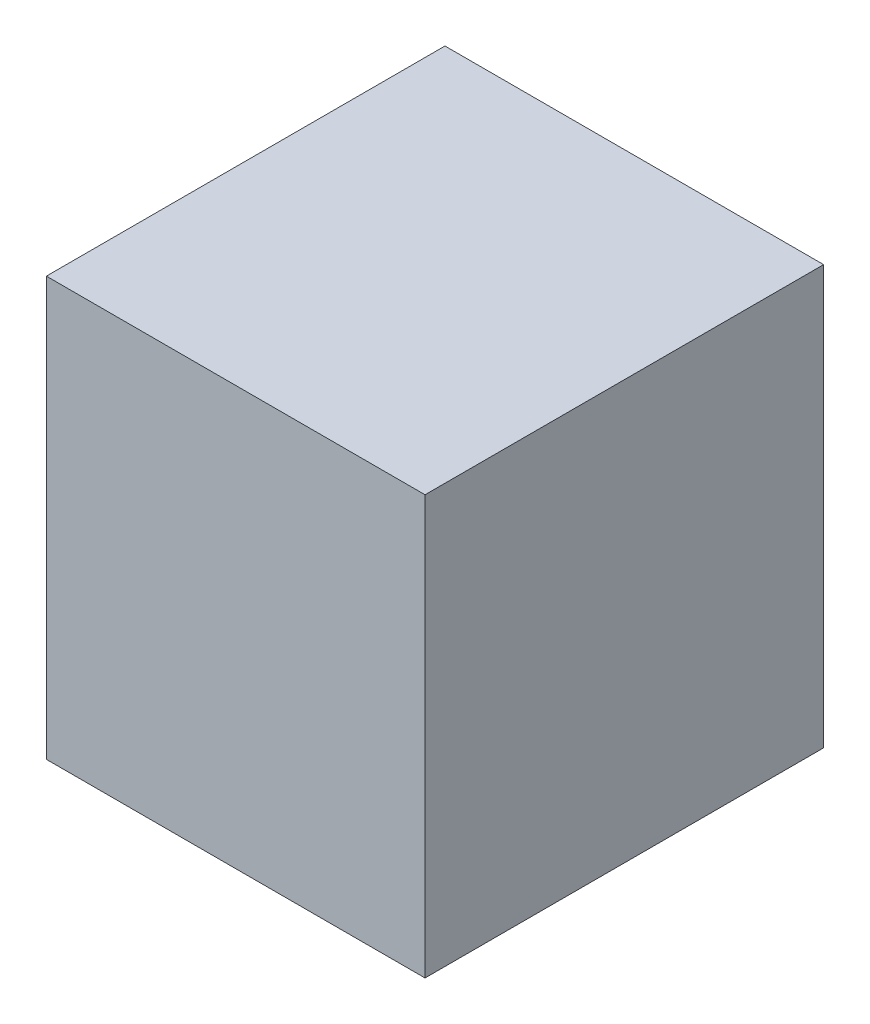
ISO-10303-21;
HEADER;
FILE_DESCRIPTION(('STEP AP214'),'2;1');
FILE_NAME('part.step','',(''),(''),'','','');
FILE_SCHEMA(('AUTOMOTIVE_DESIGN { 1 0 10303 214 1 1 1 1 }'));
ENDSEC;
DATA;
#1=APPLICATION_CONTEXT('core data for automotive mechanical design processes');
#2=APPLICATION_PROTOCOL_DEFINITION('international standard','automotive_design',2000,#1);
#3=PRODUCT_CONTEXT('',#1,'mechanical');
#4=PRODUCT('Part','Part','',(#3));
#5=PRODUCT_RELATED_PRODUCT_CATEGORY('part','',(#4));
#6=PRODUCT_DEFINITION_FORMATION('','',#4);
#7=PRODUCT_DEFINITION_CONTEXT('part definition',#1,'design');
#8=PRODUCT_DEFINITION('design','',#6,#7);
#9=PRODUCT_DEFINITION_SHAPE('','',#8);
#10=(LENGTH_UNIT() NAMED_UNIT(*) SI_UNIT(.MILLI.,.METRE.));
#11=(NAMED_UNIT(*) PLANE_ANGLE_UNIT() SI_UNIT($,.RADIAN.));
#12=(NAMED_UNIT(*) SI_UNIT($,.STERADIAN.) SOLID_ANGLE_UNIT());
#13=UNCERTAINTY_MEASURE_WITH_UNIT(LENGTH_MEASURE(1.E-05),#10,'distance_accuracy_value','');
#14=(GEOMETRIC_REPRESENTATION_CONTEXT(3) GLOBAL_UNCERTAINTY_ASSIGNED_CONTEXT((#13)) GLOBAL_UNIT_ASSIGNED_CONTEXT((#10,
#11,#12)) REPRESENTATION_CONTEXT('',''));
#15=CARTESIAN_POINT('',(0.,0.,0.));
#16=DIRECTION('',(0.,0.,1.));
#17=DIRECTION('',(1.,0.,0.));
#18=AXIS2_PLACEMENT_3D('',#15,#16,#17);
#19=CARTESIAN_POINT('',(0.47500032,0.52499768,0.));
#20=DIRECTION('',(-2.67368955473714E-06,-0.999999999996426,0.));
#21=DIRECTION('',(-0.999999999996426,2.67368955473714E-06,0.));
#22=AXIS2_PLACEMENT_3D('',#19,#20,#21);
#23=PLANE('',#22);
#24=DIRECTION('',(-0.999999999996426,2.67368955473714E-06,0.));
#25=VECTOR('',#24,1.);
#26=CARTESIAN_POINT('',(0.47500032,0.52499768,0.));
#27=LINE('',#26,#25);
#28=CARTESIAN_POINT('',(0.47500032,0.52499768,0.));
#29=VERTEX_POINT('',#28);
#30=CARTESIAN_POINT('',(-0.47499778,0.52500022,0.));
#31=VERTEX_POINT('',#30);
#32=EDGE_CURVE('E11',#29,#31,#27,.T.);
#33=ORIENTED_EDGE('',*,*,#32,.T.);
#34=DIRECTION('',(0.,0.,1.));
#35=VECTOR('',#34,1.);
#36=CARTESIAN_POINT('',(-0.47499778,0.52500022,0.));
#37=LINE('',#36,#35);
#38=CARTESIAN_POINT('',(-0.47499778,0.52500022,1.00000054));
#39=VERTEX_POINT('',#38);
#40=EDGE_CURVE('E24',#31,#39,#37,.T.);
#41=ORIENTED_EDGE('',*,*,#40,.T.);
#42=DIRECTION('',(-0.999999999996426,2.67368955473714E-06,0.));
#43=VECTOR('',#42,1.);
#44=CARTESIAN_POINT('',(0.47500032,0.52499768,1.00000054));
#45=LINE('',#44,#43);
#46=CARTESIAN_POINT('',(0.47500032,0.52499768,1.00000054));
#47=VERTEX_POINT('',#46);
#48=EDGE_CURVE('E87',#47,#39,#45,.T.);
#49=ORIENTED_EDGE('',*,*,#48,.F.);
#50=DIRECTION('',(0.,0.,1.));
#51=VECTOR('',#50,1.);
#52=CARTESIAN_POINT('',(0.47500032,0.52499768,0.));
#53=LINE('',#52,#51);
#54=EDGE_CURVE('E36',#29,#47,#53,.T.);
#55=ORIENTED_EDGE('',*,*,#54,.F.);
#56=EDGE_LOOP('',(#33,#41,#49,#55));
#57=FACE_BOUND('',#56,.T.);
#58=ADVANCED_FACE('F17',(#57),#23,.F.);
#59=CARTESIAN_POINT('',(-0.47499778,0.52500022,0.));
#60=DIRECTION('',(1.,0.,0.));
#61=DIRECTION('',(0.,-1.,0.));
#62=AXIS2_PLACEMENT_3D('',#59,#60,#61);
#63=PLANE('',#62);
#64=DIRECTION('',(0.,-1.,0.));
#65=VECTOR('',#64,1.);
#66=CARTESIAN_POINT('',(-0.47499778,0.52500022,0.));
#67=LINE('',#66,#65);
#68=CARTESIAN_POINT('',(-0.47499778,-0.52500022,0.));
#69=VERTEX_POINT('',#68);
#70=EDGE_CURVE('E84',#31,#69,#67,.T.);
#71=ORIENTED_EDGE('',*,*,#70,.T.);
#72=DIRECTION('',(0.,0.,1.));
#73=VECTOR('',#72,1.);
#74=CARTESIAN_POINT('',(-0.47499778,-0.52500022,0.));
#75=LINE('',#74,#73);
#76=CARTESIAN_POINT('',(-0.47499778,-0.52500022,1.00000054));
#77=VERTEX_POINT('',#76);
#78=EDGE_CURVE('E82',#69,#77,#75,.T.);
#79=ORIENTED_EDGE('',*,*,#78,.T.);
#80=DIRECTION('',(0.,-1.,0.));
#81=VECTOR('',#80,1.);
#82=CARTESIAN_POINT('',(-0.47499778,0.52500022,1.00000054));
#83=LINE('',#82,#81);
#84=EDGE_CURVE('E62',#39,#77,#83,.T.);
#85=ORIENTED_EDGE('',*,*,#84,.F.);
#86=ORIENTED_EDGE('',*,*,#40,.F.);
#87=EDGE_LOOP('',(#71,#79,#85,#86));
#88=FACE_BOUND('',#87,.T.);
#89=ADVANCED_FACE('F89',(#88),#63,.F.);
#90=CARTESIAN_POINT('',(-0.47499778,-0.52500022,0.));
#91=DIRECTION('',(-2.67368955473714E-06,0.999999999996426,0.));
#92=DIRECTION('',(0.999999999996426,2.67368955473714E-06,0.));
#93=AXIS2_PLACEMENT_3D('',#90,#91,#92);
#94=PLANE('',#93);
#95=DIRECTION('',(0.999999999996426,2.67368955473714E-06,0.));
#96=VECTOR('',#95,1.);
#97=CARTESIAN_POINT('',(-0.47499778,-0.52500022,0.));
#98=LINE('',#97,#96);
#99=CARTESIAN_POINT('',(0.47500032,-0.52499768,0.));
#100=VERTEX_POINT('',#99);
#101=EDGE_CURVE('E71',#69,#100,#98,.T.);
#102=ORIENTED_EDGE('',*,*,#101,.T.);
#103=DIRECTION('',(0.,0.,1.));
#104=VECTOR('',#103,1.);
#105=CARTESIAN_POINT('',(0.47500032,-0.52499768,0.));
#106=LINE('',#105,#104);
#107=CARTESIAN_POINT('',(0.47500032,-0.52499768,1.00000054));
#108=VERTEX_POINT('',#107);
#109=EDGE_CURVE('E65',#100,#108,#106,.T.);
#110=ORIENTED_EDGE('',*,*,#109,.T.);
#111=DIRECTION('',(0.999999999996426,2.67368955473714E-06,0.));
#112=VECTOR('',#111,1.);
#113=CARTESIAN_POINT('',(-0.47499778,-0.52500022,1.00000054));
#114=LINE('',#113,#112);
#115=EDGE_CURVE('E57',#77,#108,#114,.T.);
#116=ORIENTED_EDGE('',*,*,#115,.F.);
#117=ORIENTED_EDGE('',*,*,#78,.F.);
#118=EDGE_LOOP('',(#102,#110,#116,#117));
#119=FACE_BOUND('',#118,.T.);
#120=ADVANCED_FACE('F69',(#119),#94,.F.);
#121=CARTESIAN_POINT('',(0.47500032,-0.52499768,0.));
#122=DIRECTION('',(-1.,0.,0.));
#123=DIRECTION('',(0.,1.,0.));
#124=AXIS2_PLACEMENT_3D('',#121,#122,#123);
#125=PLANE('',#124);
#126=DIRECTION('',(0.,1.,0.));
#127=VECTOR('',#126,1.);
#128=CARTESIAN_POINT('',(0.47500032,-0.52499768,0.));
#129=LINE('',#128,#127);
#130=EDGE_CURVE('E66',#100,#29,#129,.T.);
#131=ORIENTED_EDGE('',*,*,#130,.T.);
#132=ORIENTED_EDGE('',*,*,#54,.T.);
#133=DIRECTION('',(0.,1.,0.));
#134=VECTOR('',#133,1.);
#135=CARTESIAN_POINT('',(0.47500032,-0.52499768,1.00000054));
#136=LINE('',#135,#134);
#137=EDGE_CURVE('E61',#108,#47,#136,.T.);
#138=ORIENTED_EDGE('',*,*,#137,.F.);
#139=ORIENTED_EDGE('',*,*,#109,.F.);
#140=EDGE_LOOP('',(#131,#132,#138,#139));
#141=FACE_BOUND('',#140,.T.);
#142=ADVANCED_FACE('F76',(#141),#125,.F.);
#143=CARTESIAN_POINT('',(0.47500032,0.52499768,0.));
#144=DIRECTION('',(0.,0.,-1.));
#145=DIRECTION('',(-1.,0.,0.));
#146=AXIS2_PLACEMENT_3D('',#143,#144,#145);
#147=PLANE('',#146);
#148=ORIENTED_EDGE('',*,*,#130,.F.);
#149=ORIENTED_EDGE('',*,*,#101,.F.);
#150=ORIENTED_EDGE('',*,*,#70,.F.);
#151=ORIENTED_EDGE('',*,*,#32,.F.);
#152=EDGE_LOOP('',(#148,#149,#150,#151));
#153=FACE_BOUND('',#152,.T.);
#154=ADVANCED_FACE('F91',(#153),#147,.T.);
#155=CARTESIAN_POINT('',(0.47500032,0.52499768,1.00000054));
#156=DIRECTION('',(0.,0.,-1.));
#157=DIRECTION('',(-1.,0.,0.));
#158=AXIS2_PLACEMENT_3D('',#155,#156,#157);
#159=PLANE('',#158);
#160=ORIENTED_EDGE('',*,*,#48,.T.);
#161=ORIENTED_EDGE('',*,*,#84,.T.);
#162=ORIENTED_EDGE('',*,*,#115,.T.);
#163=ORIENTED_EDGE('',*,*,#137,.T.);
#164=EDGE_LOOP('',(#160,#161,#162,#163));
#165=FACE_BOUND('',#164,.T.);
#166=ADVANCED_FACE('F59',(#165),#159,.F.);
#167=CLOSED_SHELL('',(#58,#89,#120,#142,#154,#166));
#168=MANIFOLD_SOLID_BREP('B1',#167);
#169=ADVANCED_BREP_SHAPE_REPRESENTATION('',(#18,#168),#14);
#170=SHAPE_DEFINITION_REPRESENTATION(#9,#169);
ENDSEC;
END-ISO-10303-21;
